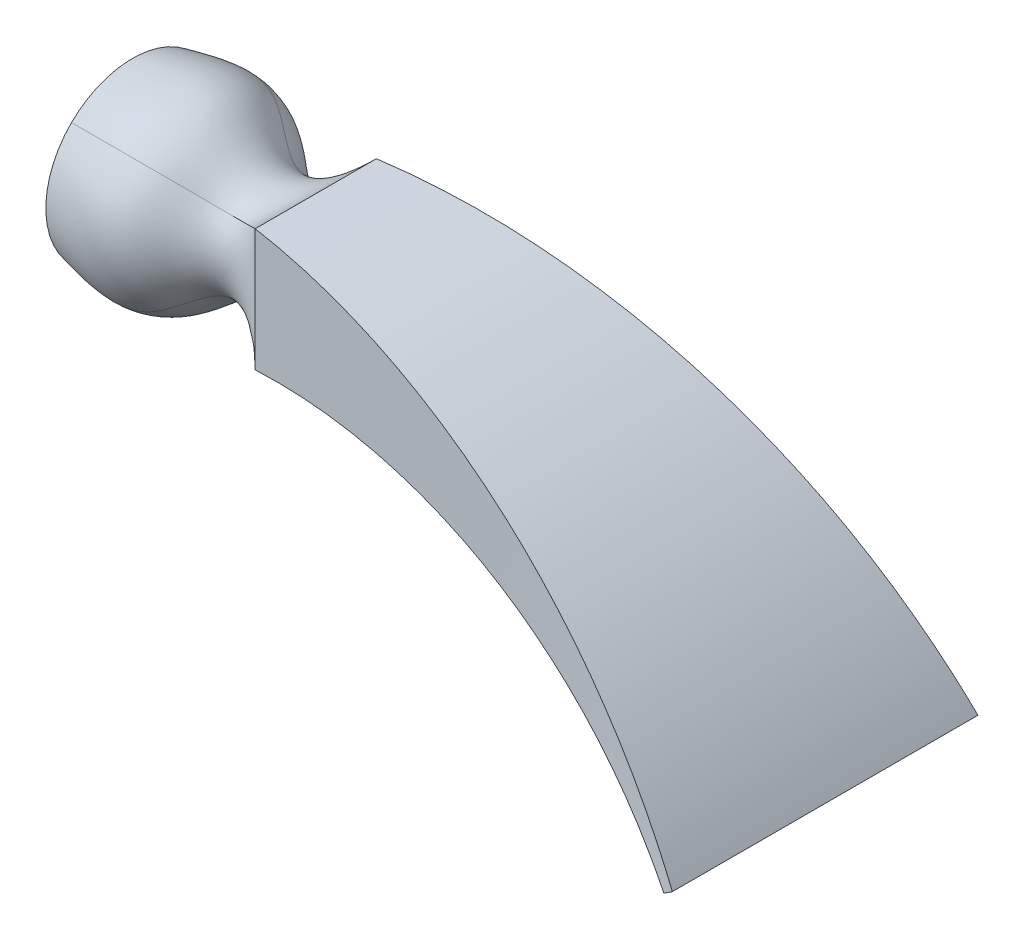
ISO-10303-21;
HEADER;
FILE_DESCRIPTION(('STEP AP214'),'2;1');
FILE_NAME('part.step','',(''),(''),'','','');
FILE_SCHEMA(('AUTOMOTIVE_DESIGN { 1 0 10303 214 1 1 1 1 }'));
ENDSEC;
DATA;
#1=APPLICATION_CONTEXT('core data for automotive mechanical design processes');
#2=APPLICATION_PROTOCOL_DEFINITION('international standard','automotive_design',2000,#1);
#3=PRODUCT_CONTEXT('',#1,'mechanical');
#4=PRODUCT('Part','Part','',(#3));
#5=PRODUCT_RELATED_PRODUCT_CATEGORY('part','',(#4));
#6=PRODUCT_DEFINITION_FORMATION('','',#4);
#7=PRODUCT_DEFINITION_CONTEXT('part definition',#1,'design');
#8=PRODUCT_DEFINITION('design','',#6,#7);
#9=PRODUCT_DEFINITION_SHAPE('','',#8);
#10=(LENGTH_UNIT() NAMED_UNIT(*) SI_UNIT(.MILLI.,.METRE.));
#11=(NAMED_UNIT(*) PLANE_ANGLE_UNIT() SI_UNIT($,.RADIAN.));
#12=(NAMED_UNIT(*) SI_UNIT($,.STERADIAN.) SOLID_ANGLE_UNIT());
#13=UNCERTAINTY_MEASURE_WITH_UNIT(LENGTH_MEASURE(1.E-05),#10,'distance_accuracy_value','');
#14=(GEOMETRIC_REPRESENTATION_CONTEXT(3) GLOBAL_UNCERTAINTY_ASSIGNED_CONTEXT((#13)) GLOBAL_UNIT_ASSIGNED_CONTEXT((#10,
#11,#12)) REPRESENTATION_CONTEXT('',''));
#15=CARTESIAN_POINT('',(0.,0.,0.));
#16=DIRECTION('',(0.,0.,1.));
#17=DIRECTION('',(1.,0.,0.));
#18=AXIS2_PLACEMENT_3D('',#15,#16,#17);
#19=CARTESIAN_POINT('',(0.,0.,0.));
#20=DIRECTION('',(1.,0.,0.));
#21=DIRECTION('',(0.,0.,-1.));
#22=AXIS2_PLACEMENT_3D('',#19,#20,#21);
#23=PLANE('',#22);
#24=CARTESIAN_POINT('',(0.,0.,0.));
#25=DIRECTION('',(1.,0.,0.));
#26=DIRECTION('',(0.,0.,-1.));
#27=AXIS2_PLACEMENT_3D('',#24,#25,#26);
#28=CIRCLE('',#27,42.5);
#29=CARTESIAN_POINT('',(0.,-30.1807389427647,-29.9227839090665));
#30=VERTEX_POINT('',#29);
#31=CARTESIAN_POINT('',(0.,30.1807389427646,-29.9227839090665));
#32=VERTEX_POINT('',#31);
#33=EDGE_CURVE('E328',#30,#32,#28,.T.);
#34=ORIENTED_EDGE('',*,*,#33,.F.);
#35=CARTESIAN_POINT('',(0.,-30.1807389427647,29.9227839090665));
#36=VERTEX_POINT('',#35);
#37=EDGE_CURVE('E333',#36,#30,#28,.T.);
#38=ORIENTED_EDGE('',*,*,#37,.F.);
#39=CARTESIAN_POINT('',(0.,30.1807389427647,29.9227839090665));
#40=VERTEX_POINT('',#39);
#41=EDGE_CURVE('E339',#40,#36,#28,.T.);
#42=ORIENTED_EDGE('',*,*,#41,.F.);
#43=EDGE_CURVE('E336',#32,#40,#28,.T.);
#44=ORIENTED_EDGE('',*,*,#43,.F.);
#45=EDGE_LOOP('',(#34,#38,#42,#44));
#46=FACE_BOUND('',#45,.T.);
#47=ADVANCED_FACE('F179',(#46),#23,.F.);
#48=CARTESIAN_POINT('',(0.,30.1807389427647,29.9227839090665));
#49=CARTESIAN_POINT('',(14.2344827586207,32.5576506885748,32.2793801698698));
#50=CARTESIAN_POINT('',(39.075112200761,36.8024435056941,36.487892706501));
#51=CARTESIAN_POINT('',(63.2703011286903,11.5236756013447,11.4251826474873));
#52=CARTESIAN_POINT('',(81.6371901141524,21.8055672932147,21.6191949231877));
#53=CARTESIAN_POINT('',(90.,30.,29.7435897435904));
#54=CARTESIAN_POINT('',(0.,28.1856718139263,31.9350498924637));
#55=CARTESIAN_POINT('',(14.2345033752936,30.3973426421206,34.4401138364509));
#56=CARTESIAN_POINT('',(39.0401593980691,34.3168229625337,38.7418698433915));
#57=CARTESIAN_POINT('',(63.3585721531963,10.9019601128463,12.7062791652942));
#58=CARTESIAN_POINT('',(81.463006869885,20.0864810901879,22.0596015987749));
#59=CARTESIAN_POINT('',(90.,27.5,29.7435897435904));
#60=CARTESIAN_POINT('',(0.,23.838624201357,35.5194678872275));
#61=CARTESIAN_POINT('',(14.2345446086393,25.7198131943193,38.3214671975825));
#62=CARTESIAN_POINT('',(38.9702537926855,28.9521532279637,42.7646827019061));
#63=CARTESIAN_POINT('',(63.5351142022081,9.39385027333037,14.9420936801908));
#64=CARTESIAN_POINT('',(81.1146403813505,16.6483086841344,22.9404149499493));
#65=CARTESIAN_POINT('',(90.0000000000001,22.5,29.7435897435904));
#66=CARTESIAN_POINT('',(0.,16.4461586886744,39.4813241775538));
#67=CARTESIAN_POINT('',(14.2344040349774,17.7403949752854,42.5894808203446));
#68=CARTESIAN_POINT('',(38.9272241139188,19.9236594843211,47.2200094175549));
#69=CARTESIAN_POINT('',(63.6439176862772,6.6107421229043,17.4087376406375));
#70=CARTESIAN_POINT('',(80.8999143592602,11.2285525991996,23.9195334519104));
#71=CARTESIAN_POINT('',(90.0000000000001,15.,29.7435897435904));
#72=CARTESIAN_POINT('',(0.,8.45557019210743,41.9339809803318));
#73=CARTESIAN_POINT('',(14.2345505476782,9.12174327247473,45.2368698899606));
#74=CARTESIAN_POINT('',(38.9060679954908,10.2233953189383,49.9791657489048));
#75=CARTESIAN_POINT('',(63.6972371834959,3.4489397791654,18.928985799055));
#76=CARTESIAN_POINT('',(80.7947216140835,5.67423491622427,24.5398668699306));
#77=CARTESIAN_POINT('',(90.,7.50000000000001,29.7435897435904));
#78=CARTESIAN_POINT('',(0.,0.,42.783009509834));
#79=CARTESIAN_POINT('',(14.2344488640919,0.,46.152254710192));
#80=CARTESIAN_POINT('',(38.9012646366428,0.,50.9342644470724));
#81=CARTESIAN_POINT('',(63.709452671535,0.,19.4561766630522));
#82=CARTESIAN_POINT('',(80.7706003535121,0.,24.7525995509965));
#83=CARTESIAN_POINT('',(89.9999999999999,0.,29.7435897435904));
#84=CARTESIAN_POINT('',(0.,-8.45557019210739,41.933980980332));
#85=CARTESIAN_POINT('',(14.2345505476783,-9.12174327247468,45.2368698899607));
#86=CARTESIAN_POINT('',(38.906067995491,-10.2233953189382,49.979165748905));
#87=CARTESIAN_POINT('',(63.6972371834958,-3.44893977916542,18.9289857990549));
#88=CARTESIAN_POINT('',(80.7947216140834,-5.67423491622429,24.5398668699305));
#89=CARTESIAN_POINT('',(90.,-7.49999999999999,29.7435897435904));
#90=CARTESIAN_POINT('',(0.,-16.4461586886745,39.4813241775537));
#91=CARTESIAN_POINT('',(14.2344040349774,-17.7403949752855,42.5894808203444));
#92=CARTESIAN_POINT('',(38.9272241139187,-19.9236594843211,47.2200094175547));
#93=CARTESIAN_POINT('',(63.6439176862774,-6.61074212290429,17.4087376406376));
#94=CARTESIAN_POINT('',(80.8999143592602,-11.2285525991995,23.9195334519104));
#95=CARTESIAN_POINT('',(90.0000000000001,-15.,29.7435897435904));
#96=CARTESIAN_POINT('',(0.,-23.838624201357,35.5194678872276));
#97=CARTESIAN_POINT('',(14.2345446086393,-25.7198131943192,38.3214671975826));
#98=CARTESIAN_POINT('',(38.9702537926856,-28.9521532279636,42.7646827019063));
#99=CARTESIAN_POINT('',(63.535114202208,-9.39385027333037,14.9420936801907));
#100=CARTESIAN_POINT('',(81.1146403813505,-16.6483086841344,22.9404149499492));
#101=CARTESIAN_POINT('',(90.,-22.5,29.7435897435904));
#102=CARTESIAN_POINT('',(0.,-28.1856718139263,31.9350498924637));
#103=CARTESIAN_POINT('',(14.2345033752936,-30.3973426421205,34.4401138364509));
#104=CARTESIAN_POINT('',(39.0401593980691,-34.3168229625337,38.7418698433915));
#105=CARTESIAN_POINT('',(63.3585721531963,-10.9019601128463,12.7062791652942));
#106=CARTESIAN_POINT('',(81.463006869885,-20.086481090188,22.0596015987749));
#107=CARTESIAN_POINT('',(90.,-27.5,29.7435897435904));
#108=CARTESIAN_POINT('',(0.,-30.1807389427647,29.9227839090665));
#109=CARTESIAN_POINT('',(14.2344827586207,-32.5576506885748,32.2793801698698));
#110=CARTESIAN_POINT('',(39.075112200761,-36.8024435056941,36.487892706501));
#111=CARTESIAN_POINT('',(63.2703011286903,-11.5236756013447,11.4251826474873));
#112=CARTESIAN_POINT('',(81.6371901141524,-21.8055672932147,21.6191949231877));
#113=CARTESIAN_POINT('',(90.,-30.,29.7435897435904));
#114=B_SPLINE_SURFACE_WITH_KNOTS('',3,3,((#48,#49,#50,#51,#52,#53),(#54,#55,#56,#57,#58,#59),
(#60,#61,#62,#63,#64,#65),(#66,#67,#68,#69,#70,#71),(#72,#73,#74,#75,#76,#77),(#78,#79,#80,#81,
#82,#83),(#84,#85,#86,#87,#88,#89),(#90,#91,#92,#93,#94,#95),(#96,#97,#98,#99,#100,#101),(#102,
#103,#104,#105,#106,#107),(#108,#109,#110,#111,#112,#113)),.UNSPECIFIED.,.F.,.F.,.F.,(4,1,1,1,1,
1,1,1,4),(4,1,1,4),(0.,0.125,0.25,0.375,0.5,0.625,0.75,0.875,1.),(0.,0.406350228999351,
0.716358770858521,1.),.UNSPECIFIED.);
#115=CARTESIAN_POINT('',(0.,-30.1807389427647,29.9227839090665));
#116=CARTESIAN_POINT('',(14.2344827586207,-32.5576506885748,32.2793801698698));
#117=CARTESIAN_POINT('',(39.075112200761,-36.8024435056941,36.487892706501));
#118=CARTESIAN_POINT('',(63.2703011286903,-11.5236756013447,11.4251826474873));
#119=CARTESIAN_POINT('',(81.6371901141524,-21.8055672932147,21.6191949231877));
#120=CARTESIAN_POINT('',(90.,-30.,29.7435897435904));
#121=B_SPLINE_CURVE_WITH_KNOTS('',3,(#115,#116,#117,#118,#119,#120),.UNSPECIFIED.,.F.,.F.,(4,1,
1,4),(0.,0.406350228999351,0.716358770858521,1.),.UNSPECIFIED.);
#122=CARTESIAN_POINT('',(90.,-30.,29.7435897435904));
#123=VERTEX_POINT('',#122);
#124=EDGE_CURVE('E394',#36,#123,#121,.T.);
#125=DIRECTION('',(0.,-1.,0.));
#126=VECTOR('',#125,1.);
#127=CARTESIAN_POINT('',(90.,30.,29.7435897435904));
#128=LINE('',#127,#126);
#129=CARTESIAN_POINT('',(90.,30.,29.7435897435904));
#130=VERTEX_POINT('',#129);
#131=EDGE_CURVE('E191',#130,#123,#128,.T.);
#132=CARTESIAN_POINT('',(0.,30.1807389427647,29.9227839090665));
#133=CARTESIAN_POINT('',(14.2344827586207,32.5576506885748,32.2793801698698));
#134=CARTESIAN_POINT('',(39.075112200761,36.8024435056941,36.487892706501));
#135=CARTESIAN_POINT('',(63.2703011286903,11.5236756013447,11.4251826474873));
#136=CARTESIAN_POINT('',(81.6371901141524,21.8055672932147,21.6191949231877));
#137=CARTESIAN_POINT('',(90.,30.,29.7435897435904));
#138=B_SPLINE_CURVE_WITH_KNOTS('',3,(#132,#133,#134,#135,#136,#137),.UNSPECIFIED.,.F.,.F.,(4,1,
1,4),(0.,0.406350228999351,0.716358770858521,1.),.UNSPECIFIED.);
#139=EDGE_CURVE('E405',#130,#40,#138,.F.);
#140=ORIENTED_EDGE('',*,*,#41,.T.);
#141=ORIENTED_EDGE('',*,*,#124,.T.);
#142=ORIENTED_EDGE('',*,*,#131,.F.);
#143=ORIENTED_EDGE('',*,*,#139,.T.);
#144=EDGE_LOOP('',(#140,#141,#142,#143));
#145=FACE_BOUND('',#144,.T.);
#146=ADVANCED_FACE('F360',(#145),#114,.T.);
#147=CARTESIAN_POINT('',(0.,-30.1807389427646,29.9227839090665));
#148=CARTESIAN_POINT('',(14.2344827586207,-32.5576506885748,32.2793801698698));
#149=CARTESIAN_POINT('',(39.075112200761,-36.8024435056941,36.487892706501));
#150=CARTESIAN_POINT('',(63.2703011286903,-11.5236756013447,11.4251826474873));
#151=CARTESIAN_POINT('',(81.6371901141524,-21.8055672932147,21.6191949231877));
#152=CARTESIAN_POINT('',(90.,-30.,29.7435897435904));
#153=CARTESIAN_POINT('',(0.,-46.5957018317999,13.3663127192641));
#154=CARTESIAN_POINT('',(14.2344827586207,-48.97261357761,14.1518448061986));
#155=CARTESIAN_POINT('',(39.075112200761,-54.8967982265609,15.9017183415848));
#156=CARTESIAN_POINT('',(63.2703011286903,-23.6966390740378,6.32386246674985));
#157=CARTESIAN_POINT('',(81.6371901141524,-21.8055672932147,7.20639830772924));
#158=CARTESIAN_POINT('',(90.,-30.,9.91452991453014));
#159=CARTESIAN_POINT('',(0.,-46.5957018317999,-13.3663127192641));
#160=CARTESIAN_POINT('',(14.2344827586207,-48.97261357761,-14.1518448061985));
#161=CARTESIAN_POINT('',(39.075112200761,-54.8967982265609,-15.9017183415847));
#162=CARTESIAN_POINT('',(63.2703011286903,-23.6966390740378,-6.32386246674984));
#163=CARTESIAN_POINT('',(81.6371901141524,-21.8055672932147,-7.20639830772924));
#164=CARTESIAN_POINT('',(90.,-30.,-9.91452991453014));
#165=CARTESIAN_POINT('',(0.,-30.1807389427647,-29.9227839090665));
#166=CARTESIAN_POINT('',(14.2344827586207,-32.5576506885748,-32.2793801698698));
#167=CARTESIAN_POINT('',(39.075112200761,-36.8024435056941,-36.487892706501));
#168=CARTESIAN_POINT('',(63.2703011286903,-11.5236756013447,-11.4251826474873));
#169=CARTESIAN_POINT('',(81.6371901141524,-21.8055672932147,-21.6191949231877));
#170=CARTESIAN_POINT('',(90.,-30.,-29.7435897435904));
#171=B_SPLINE_SURFACE_WITH_KNOTS('',3,3,((#147,#148,#149,#150,#151,#152),(#153,#154,#155,#156,
#157,#158),(#159,#160,#161,#162,#163,#164),(#165,#166,#167,#168,#169,#170)),.UNSPECIFIED.,.F.,
.F.,.F.,(4,4),(4,1,1,4),(0.,1.),(0.,0.406350228999351,0.716358770858521,1.),.UNSPECIFIED.);
#172=CARTESIAN_POINT('',(0.,-30.1807389427647,-29.9227839090665));
#173=CARTESIAN_POINT('',(14.2344827586207,-32.5576506885748,-32.2793801698698));
#174=CARTESIAN_POINT('',(39.075112200761,-36.8024435056941,-36.487892706501));
#175=CARTESIAN_POINT('',(63.2703011286903,-11.5236756013447,-11.4251826474873));
#176=CARTESIAN_POINT('',(81.6371901141524,-21.8055672932147,-21.6191949231877));
#177=CARTESIAN_POINT('',(90.,-30.,-29.7435897435904));
#178=B_SPLINE_CURVE_WITH_KNOTS('',3,(#172,#173,#174,#175,#176,#177),.UNSPECIFIED.,.F.,.F.,(4,1,
1,4),(0.,0.406350228999351,0.716358770858521,1.),.UNSPECIFIED.);
#179=CARTESIAN_POINT('',(90.,-30.,-29.7435897435904));
#180=VERTEX_POINT('',#179);
#181=EDGE_CURVE('E392',#30,#180,#178,.T.);
#182=DIRECTION('',(0.,0.,-1.));
#183=VECTOR('',#182,1.);
#184=CARTESIAN_POINT('',(90.,-30.,29.7435897435904));
#185=LINE('',#184,#183);
#186=EDGE_CURVE('E248',#123,#180,#185,.T.);
#187=ORIENTED_EDGE('',*,*,#37,.T.);
#188=ORIENTED_EDGE('',*,*,#181,.T.);
#189=ORIENTED_EDGE('',*,*,#186,.F.);
#190=ORIENTED_EDGE('',*,*,#124,.F.);
#191=EDGE_LOOP('',(#187,#188,#189,#190));
#192=FACE_BOUND('',#191,.T.);
#193=ADVANCED_FACE('F441',(#192),#171,.T.);
#194=CARTESIAN_POINT('',(0.,30.1807389427647,-29.9227839090665));
#195=CARTESIAN_POINT('',(14.2344827586207,32.5576506885748,-32.2793801698698));
#196=CARTESIAN_POINT('',(39.075112200761,36.8024435056941,-36.487892706501));
#197=CARTESIAN_POINT('',(63.2703011286903,11.5236756013447,-11.4251826474873));
#198=CARTESIAN_POINT('',(81.6371901141524,21.8055672932147,-21.6191949231877));
#199=CARTESIAN_POINT('',(90.,30.,-29.7435897435904));
#200=CARTESIAN_POINT('',(0.,46.5957018317999,-13.3663127192641));
#201=CARTESIAN_POINT('',(14.2344827586207,48.97261357761,-14.1518448061985));
#202=CARTESIAN_POINT('',(39.075112200761,54.8967982265609,-15.9017183415847));
#203=CARTESIAN_POINT('',(63.2703011286903,23.6966390740378,-6.32386246674984));
#204=CARTESIAN_POINT('',(81.6371901141524,21.8055672932147,-7.20639830772924));
#205=CARTESIAN_POINT('',(90.,30.,-9.91452991453014));
#206=CARTESIAN_POINT('',(0.,46.5957018317999,13.3663127192641));
#207=CARTESIAN_POINT('',(14.2344827586207,48.97261357761,14.1518448061986));
#208=CARTESIAN_POINT('',(39.075112200761,54.8967982265609,15.9017183415848));
#209=CARTESIAN_POINT('',(63.2703011286903,23.6966390740378,6.32386246674984));
#210=CARTESIAN_POINT('',(81.6371901141524,21.8055672932147,7.20639830772924));
#211=CARTESIAN_POINT('',(90.,30.,9.91452991453014));
#212=CARTESIAN_POINT('',(0.,30.1807389427647,29.9227839090665));
#213=CARTESIAN_POINT('',(14.2344827586207,32.5576506885748,32.2793801698698));
#214=CARTESIAN_POINT('',(39.075112200761,36.8024435056941,36.487892706501));
#215=CARTESIAN_POINT('',(63.2703011286903,11.5236756013447,11.4251826474873));
#216=CARTESIAN_POINT('',(81.6371901141524,21.8055672932147,21.6191949231877));
#217=CARTESIAN_POINT('',(90.,30.,29.7435897435904));
#218=B_SPLINE_SURFACE_WITH_KNOTS('',3,3,((#194,#195,#196,#197,#198,#199),(#200,#201,#202,#203,
#204,#205),(#206,#207,#208,#209,#210,#211),(#212,#213,#214,#215,#216,#217)),.UNSPECIFIED.,.F.,
.F.,.F.,(4,4),(4,1,1,4),(0.,1.),(0.,0.406350228999351,0.716358770858521,1.),.UNSPECIFIED.);
#219=DIRECTION('',(0.,0.,1.));
#220=VECTOR('',#219,1.);
#221=CARTESIAN_POINT('',(90.,30.,29.7435897435904));
#222=LINE('',#221,#220);
#223=CARTESIAN_POINT('',(90.,30.,-29.7435897435904));
#224=VERTEX_POINT('',#223);
#225=EDGE_CURVE('E13',#224,#130,#222,.T.);
#226=CARTESIAN_POINT('',(0.,30.1807389427646,-29.9227839090665));
#227=CARTESIAN_POINT('',(14.2344827586207,32.5576506885748,-32.2793801698698));
#228=CARTESIAN_POINT('',(39.075112200761,36.8024435056941,-36.487892706501));
#229=CARTESIAN_POINT('',(63.2703011286903,11.5236756013447,-11.4251826474873));
#230=CARTESIAN_POINT('',(81.6371901141524,21.8055672932147,-21.6191949231877));
#231=CARTESIAN_POINT('',(90.,30.,-29.7435897435904));
#232=B_SPLINE_CURVE_WITH_KNOTS('',3,(#226,#227,#228,#229,#230,#231),.UNSPECIFIED.,.F.,.F.,(4,1,
1,4),(0.,0.406350228999351,0.716358770858521,1.),.UNSPECIFIED.);
#233=EDGE_CURVE('E391',#32,#224,#232,.T.);
#234=ORIENTED_EDGE('',*,*,#43,.T.);
#235=ORIENTED_EDGE('',*,*,#139,.F.);
#236=ORIENTED_EDGE('',*,*,#225,.F.);
#237=ORIENTED_EDGE('',*,*,#233,.F.);
#238=EDGE_LOOP('',(#234,#235,#236,#237));
#239=FACE_BOUND('',#238,.T.);
#240=ADVANCED_FACE('F431',(#239),#218,.T.);
#241=CARTESIAN_POINT('',(0.,-30.1807389427647,-29.9227839090665));
#242=CARTESIAN_POINT('',(14.2344827586207,-32.5576506885748,-32.2793801698698));
#243=CARTESIAN_POINT('',(39.075112200761,-36.8024435056941,-36.487892706501));
#244=CARTESIAN_POINT('',(63.2703011286903,-11.5236756013447,-11.4251826474873));
#245=CARTESIAN_POINT('',(81.6371901141524,-21.8055672932147,-21.6191949231877));
#246=CARTESIAN_POINT('',(90.,-30.,-29.7435897435904));
#247=CARTESIAN_POINT('',(0.,-28.1856718139264,-31.9350498924637));
#248=CARTESIAN_POINT('',(14.2345033752936,-30.3973426421205,-34.4401138364509));
#249=CARTESIAN_POINT('',(39.0401593980691,-34.3168229625337,-38.7418698433915));
#250=CARTESIAN_POINT('',(63.3585721531963,-10.9019601128463,-12.7062791652942));
#251=CARTESIAN_POINT('',(81.463006869885,-20.086481090188,-22.0596015987749));
#252=CARTESIAN_POINT('',(90.,-27.5,-29.7435897435904));
#253=CARTESIAN_POINT('',(0.,-23.838624201357,-35.5194678872275));
#254=CARTESIAN_POINT('',(14.2345446086393,-25.7198131943192,-38.3214671975825));
#255=CARTESIAN_POINT('',(38.9702537926855,-28.9521532279636,-42.7646827019061));
#256=CARTESIAN_POINT('',(63.5351142022081,-9.39385027333039,-14.9420936801908));
#257=CARTESIAN_POINT('',(81.1146403813505,-16.6483086841344,-22.9404149499493));
#258=CARTESIAN_POINT('',(90.0000000000001,-22.5,-29.7435897435904));
#259=CARTESIAN_POINT('',(0.,-16.4461586886745,-39.4813241775538));
#260=CARTESIAN_POINT('',(14.2344040349774,-17.7403949752855,-42.5894808203446));
#261=CARTESIAN_POINT('',(38.9272241139188,-19.9236594843211,-47.2200094175549));
#262=CARTESIAN_POINT('',(63.6439176862772,-6.6107421229043,-17.4087376406375));
#263=CARTESIAN_POINT('',(80.8999143592602,-11.2285525991995,-23.9195334519104));
#264=CARTESIAN_POINT('',(90.0000000000001,-15.,-29.7435897435904));
#265=CARTESIAN_POINT('',(0.,-8.45557019210741,-41.9339809803318));
#266=CARTESIAN_POINT('',(14.2345505476782,-9.1217432724747,-45.2368698899606));
#267=CARTESIAN_POINT('',(38.9060679954908,-10.2233953189382,-49.9791657489048));
#268=CARTESIAN_POINT('',(63.6972371834959,-3.44893977916541,-18.928985799055));
#269=CARTESIAN_POINT('',(80.7947216140835,-5.67423491622428,-24.5398668699306));
#270=CARTESIAN_POINT('',(90.,-7.5,-29.7435897435904));
#271=CARTESIAN_POINT('',(0.,0.,-42.783009509834));
#272=CARTESIAN_POINT('',(14.2344488640919,0.,-46.152254710192));
#273=CARTESIAN_POINT('',(38.9012646366428,0.,-50.9342644470724));
#274=CARTESIAN_POINT('',(63.709452671535,0.,-19.4561766630522));
#275=CARTESIAN_POINT('',(80.7706003535121,0.,-24.7525995509965));
#276=CARTESIAN_POINT('',(89.9999999999999,0.,-29.7435897435904));
#277=CARTESIAN_POINT('',(0.,8.45557019210739,-41.933980980332));
#278=CARTESIAN_POINT('',(14.2345505476783,9.12174327247468,-45.2368698899607));
#279=CARTESIAN_POINT('',(38.906067995491,10.2233953189382,-49.979165748905));
#280=CARTESIAN_POINT('',(63.6972371834958,3.44893977916541,-18.9289857990549));
#281=CARTESIAN_POINT('',(80.7947216140834,5.67423491622428,-24.5398668699305));
#282=CARTESIAN_POINT('',(90.,7.50000000000001,-29.7435897435904));
#283=CARTESIAN_POINT('',(0.,16.4461586886744,-39.4813241775537));
#284=CARTESIAN_POINT('',(14.2344040349774,17.7403949752855,-42.5894808203444));
#285=CARTESIAN_POINT('',(38.9272241139187,19.9236594843211,-47.2200094175547));
#286=CARTESIAN_POINT('',(63.6439176862774,6.61074212290428,-17.4087376406376));
#287=CARTESIAN_POINT('',(80.8999143592602,11.2285525991995,-23.9195334519104));
#288=CARTESIAN_POINT('',(90.0000000000001,15.,-29.7435897435904));
#289=CARTESIAN_POINT('',(0.,23.8386242013569,-35.5194678872276));
#290=CARTESIAN_POINT('',(14.2345446086393,25.7198131943192,-38.3214671975826));
#291=CARTESIAN_POINT('',(38.9702537926856,28.9521532279636,-42.7646827019063));
#292=CARTESIAN_POINT('',(63.535114202208,9.39385027333038,-14.9420936801907));
#293=CARTESIAN_POINT('',(81.1146403813505,16.6483086841345,-22.9404149499492));
#294=CARTESIAN_POINT('',(90.,22.5,-29.7435897435904));
#295=CARTESIAN_POINT('',(0.,28.1856718139263,-31.9350498924637));
#296=CARTESIAN_POINT('',(14.2345033752936,30.3973426421205,-34.4401138364509));
#297=CARTESIAN_POINT('',(39.0401593980691,34.3168229625337,-38.7418698433915));
#298=CARTESIAN_POINT('',(63.3585721531963,10.9019601128463,-12.7062791652942));
#299=CARTESIAN_POINT('',(81.463006869885,20.0864810901879,-22.0596015987749));
#300=CARTESIAN_POINT('',(90.,27.5,-29.7435897435904));
#301=CARTESIAN_POINT('',(0.,30.1807389427646,-29.9227839090665));
#302=CARTESIAN_POINT('',(14.2344827586207,32.5576506885748,-32.2793801698698));
#303=CARTESIAN_POINT('',(39.075112200761,36.8024435056941,-36.487892706501));
#304=CARTESIAN_POINT('',(63.2703011286903,11.5236756013447,-11.4251826474873));
#305=CARTESIAN_POINT('',(81.6371901141524,21.8055672932147,-21.6191949231877));
#306=CARTESIAN_POINT('',(90.,30.,-29.7435897435904));
#307=B_SPLINE_SURFACE_WITH_KNOTS('',3,3,((#241,#242,#243,#244,#245,#246),(#247,#248,#249,#250,
#251,#252),(#253,#254,#255,#256,#257,#258),(#259,#260,#261,#262,#263,#264),(#265,#266,#267,#268,
#269,#270),(#271,#272,#273,#274,#275,#276),(#277,#278,#279,#280,#281,#282),(#283,#284,#285,#286,
#287,#288),(#289,#290,#291,#292,#293,#294),(#295,#296,#297,#298,#299,#300),(#301,#302,#303,#304,
#305,#306)),.UNSPECIFIED.,.F.,.F.,.F.,(4,1,1,1,1,1,1,1,4),(4,1,1,4),(0.,0.125,0.25,0.375,0.5,
0.625,0.75,0.875,1.),(0.,0.406350228999351,0.716358770858521,1.),.UNSPECIFIED.);
#308=DIRECTION('',(0.,1.,0.));
#309=VECTOR('',#308,1.);
#310=CARTESIAN_POINT('',(90.,30.,-29.7435897435904));
#311=LINE('',#310,#309);
#312=EDGE_CURVE('E206',#180,#224,#311,.T.);
#313=ORIENTED_EDGE('',*,*,#33,.T.);
#314=ORIENTED_EDGE('',*,*,#233,.T.);
#315=ORIENTED_EDGE('',*,*,#312,.F.);
#316=ORIENTED_EDGE('',*,*,#181,.F.);
#317=EDGE_LOOP('',(#313,#314,#315,#316));
#318=FACE_BOUND('',#317,.T.);
#319=ADVANCED_FACE('F181',(#318),#307,.T.);
#320=CARTESIAN_POINT('',(151.873429638329,-228.957809879443,0.));
#321=DIRECTION('',(-0.552770798392569,0.833333333333332,0.));
#322=DIRECTION('',(-0.833333333333332,-0.552770798392569,0.));
#323=AXIS2_PLACEMENT_3D('',#320,#321,#322);
#324=PLANE('',#323);
#325=DIRECTION('',(0.,0.,1.));
#326=VECTOR('',#325,1.);
#327=CARTESIAN_POINT('',(340.,-104.16876048223,-75.));
#328=LINE('',#327,#326);
#329=CARTESIAN_POINT('',(340.,-104.16876048223,-75.));
#330=VERTEX_POINT('',#329);
#331=CARTESIAN_POINT('',(340.,-104.16876048223,75.));
#332=VERTEX_POINT('',#331);
#333=EDGE_CURVE('E311',#330,#332,#328,.T.);
#334=ORIENTED_EDGE('',*,*,#333,.T.);
#335=DIRECTION('',(-0.833333333333332,-0.552770798392569,0.));
#336=VECTOR('',#335,1.);
#337=CARTESIAN_POINT('',(335.833333333333,-106.932614474193,75.));
#338=LINE('',#337,#336);
#339=CARTESIAN_POINT('',(335.833333333333,-106.932614474193,75.));
#340=VERTEX_POINT('',#339);
#341=EDGE_CURVE('E268',#332,#340,#338,.T.);
#342=ORIENTED_EDGE('',*,*,#341,.T.);
#343=DIRECTION('',(0.,0.,-1.));
#344=VECTOR('',#343,1.);
#345=CARTESIAN_POINT('',(335.833333333333,-106.932614474193,-75.));
#346=LINE('',#345,#344);
#347=CARTESIAN_POINT('',(335.833333333333,-106.932614474193,-75.));
#348=VERTEX_POINT('',#347);
#349=EDGE_CURVE('E245',#340,#348,#346,.T.);
#350=ORIENTED_EDGE('',*,*,#349,.T.);
#351=DIRECTION('',(0.833333333333334,0.552770798392565,0.));
#352=VECTOR('',#351,1.);
#353=CARTESIAN_POINT('',(335.833333333333,-106.932614474193,-75.));
#354=LINE('',#353,#352);
#355=EDGE_CURVE('E254',#348,#330,#354,.T.);
#356=ORIENTED_EDGE('',*,*,#355,.T.);
#357=EDGE_LOOP('',(#334,#342,#350,#356));
#358=FACE_BOUND('',#357,.T.);
#359=ADVANCED_FACE('F267',(#358),#324,.F.);
#360=CARTESIAN_POINT('',(90.,30.,-29.7435897435904));
#361=CARTESIAN_POINT('',(190.541679184982,30.,-44.8290598290603));
#362=CARTESIAN_POINT('',(284.423495725188,-20.3840278280784,-59.9145299145301));
#363=CARTESIAN_POINT('',(340.,-104.16876048223,-75.));
#364=CARTESIAN_POINT('',(90.,30.,-25.4188435719088));
#365=CARTESIAN_POINT('',(190.541679184982,30.,-40.6608282807347));
#366=CARTESIAN_POINT('',(284.423495725188,-20.3840278280784,-55.9028129895607));
#367=CARTESIAN_POINT('',(340.,-104.16876048223,-71.1447976983867));
#368=CARTESIAN_POINT('',(90.0000000000001,30.,-20.3965397397558));
#369=CARTESIAN_POINT('',(190.541679184982,30.,-34.4239884974845));
#370=CARTESIAN_POINT('',(284.423495725189,-20.3840278280784,-48.4514372552131));
#371=CARTESIAN_POINT('',(340.,-104.16876048223,-62.4788860129418));
#372=CARTESIAN_POINT('',(89.9999999999999,30.,-13.2831704179637));
#373=CARTESIAN_POINT('',(190.541679184982,30.,-23.9708507884073));
#374=CARTESIAN_POINT('',(284.423495725188,-20.3840278280784,-34.6585311588509));
#375=CARTESIAN_POINT('',(340.,-104.16876048223,-45.3462115292945));
#376=CARTESIAN_POINT('',(90.0000000000001,30.,-7.01390888564618));
#377=CARTESIAN_POINT('',(190.541679184982,30.0000000000001,-11.740362593087));
#378=CARTESIAN_POINT('',(284.423495725188,-20.3840278280783,-16.4668163005278));
#379=CARTESIAN_POINT('',(340.,-104.16876048223,-21.1932700079687));
#380=CARTESIAN_POINT('',(90.,30.,-2.47863247863253));
#381=CARTESIAN_POINT('',(190.541679184982,30.,-3.73575498575502));
#382=CARTESIAN_POINT('',(284.423495725188,-20.3840278280784,-4.99287749287751));
#383=CARTESIAN_POINT('',(340.,-104.16876048223,-6.25));
#384=CARTESIAN_POINT('',(90.,30.,2.47863247863253));
#385=CARTESIAN_POINT('',(190.541679184982,30.,3.73575498575502));
#386=CARTESIAN_POINT('',(284.423495725188,-20.3840278280784,4.99287749287751));
#387=CARTESIAN_POINT('',(340.,-104.16876048223,6.25));
#388=CARTESIAN_POINT('',(90.,30.,7.01390888564618));
#389=CARTESIAN_POINT('',(190.541679184982,30.,11.740362593087));
#390=CARTESIAN_POINT('',(284.423495725188,-20.3840278280784,16.4668163005279));
#391=CARTESIAN_POINT('',(340.,-104.16876048223,21.1932700079687));
#392=CARTESIAN_POINT('',(90.,30.,13.2831704179637));
#393=CARTESIAN_POINT('',(190.541679184982,30.,23.9708507884073));
#394=CARTESIAN_POINT('',(284.423495725188,-20.3840278280784,34.6585311588509));
#395=CARTESIAN_POINT('',(340.,-104.16876048223,45.3462115292945));
#396=CARTESIAN_POINT('',(90.,30.,20.3965397397558));
#397=CARTESIAN_POINT('',(190.541679184982,30.,34.4239884974845));
#398=CARTESIAN_POINT('',(284.423495725188,-20.3840278280784,48.4514372552131));
#399=CARTESIAN_POINT('',(340.,-104.16876048223,62.4788860129418));
#400=CARTESIAN_POINT('',(90.,30.,25.4188435719088));
#401=CARTESIAN_POINT('',(190.541679184982,30.,40.6608282807347));
#402=CARTESIAN_POINT('',(284.423495725188,-20.3840278280784,55.9028129895607));
#403=CARTESIAN_POINT('',(340.,-104.16876048223,71.1447976983867));
#404=CARTESIAN_POINT('',(90.,30.,29.7435897435904));
#405=CARTESIAN_POINT('',(190.541679184982,30.,44.8290598290603));
#406=CARTESIAN_POINT('',(284.423495725188,-20.3840278280784,59.9145299145301));
#407=CARTESIAN_POINT('',(340.,-104.16876048223,75.));
#408=B_SPLINE_SURFACE_WITH_KNOTS('',3,3,((#360,#361,#362,#363),(#364,#365,#366,#367),(#368,#369,
#370,#371),(#372,#373,#374,#375),(#376,#377,#378,#379),(#380,#381,#382,#383),(#384,#385,#386,
#387),(#388,#389,#390,#391),(#392,#393,#394,#395),(#396,#397,#398,#399),(#400,#401,#402,#403),
(#404,#405,#406,#407)),.UNSPECIFIED.,.F.,.F.,.F.,(4,1,1,1,2,1,1,1,4),(4,4),(0.633600996815726,
0.67940087221376,0.725200747611795,0.771000623009829,0.816800498407863,0.862600373805897,
0.908400249203931,0.954200124601966,1.),(0.,1.),.UNSPECIFIED.);
#409=CARTESIAN_POINT('',(90.,30.,29.7435897435904));
#410=CARTESIAN_POINT('',(190.541679184982,30.,44.8290598290603));
#411=CARTESIAN_POINT('',(284.423495725188,-20.3840278280784,59.9145299145301));
#412=CARTESIAN_POINT('',(340.,-104.16876048223,75.));
#413=B_SPLINE_CURVE_WITH_KNOTS('',3,(#409,#410,#411,#412),.UNSPECIFIED.,.F.,.F.,(4,4),(0.,1.),.UNSPECIFIED.);
#414=EDGE_CURVE('E468',#130,#332,#413,.T.);
#415=CARTESIAN_POINT('',(90.,30.,-29.7435897435904));
#416=CARTESIAN_POINT('',(190.541679184982,30.,-44.8290598290603));
#417=CARTESIAN_POINT('',(284.423495725188,-20.3840278280784,-59.9145299145301));
#418=CARTESIAN_POINT('',(340.,-104.16876048223,-75.));
#419=B_SPLINE_CURVE_WITH_KNOTS('',3,(#415,#416,#417,#418),.UNSPECIFIED.,.F.,.F.,(4,4),(0.,1.),.UNSPECIFIED.);
#420=EDGE_CURVE('E250',#224,#330,#419,.T.);
#421=ORIENTED_EDGE('',*,*,#225,.T.);
#422=ORIENTED_EDGE('',*,*,#414,.T.);
#423=ORIENTED_EDGE('',*,*,#333,.F.);
#424=ORIENTED_EDGE('',*,*,#420,.F.);
#425=EDGE_LOOP('',(#421,#422,#423,#424));
#426=FACE_BOUND('',#425,.T.);
#427=ADVANCED_FACE('F287',(#426),#408,.T.);
#428=CARTESIAN_POINT('',(90.,-30.,-29.7435897435904));
#429=CARTESIAN_POINT('',(189.152790296093,-10.9212846639876,-44.8290598290603));
#430=CARTESIAN_POINT('',(281.64571794741,-42.2265971560536,-59.9145299145301));
#431=CARTESIAN_POINT('',(335.833333333333,-106.932614474193,-75.));
#432=CARTESIAN_POINT('',(90.,-25.,-29.7435897435904));
#433=CARTESIAN_POINT('',(189.268531036834,-7.51117760865525,-44.8290598290603));
#434=CARTESIAN_POINT('',(281.877199428892,-40.406383045389,-59.9145299145301));
#435=CARTESIAN_POINT('',(336.180555555556,-106.702293308196,-75.));
#436=CARTESIAN_POINT('',(89.9999999999999,-15.,-29.7435897435904));
#437=CARTESIAN_POINT('',(189.500012518315,-0.690963497990693,-44.8290598290603));
#438=CARTESIAN_POINT('',(282.340162391855,-36.7659548240598,-59.9145299145301));
#439=CARTESIAN_POINT('',(336.875,-106.241650976202,-74.9999999999999));
#440=CARTESIAN_POINT('',(90.0000000000002,0.,-29.7435897435904));
#441=CARTESIAN_POINT('',(189.847234740538,9.53935766800628,-44.8290598290603));
#442=CARTESIAN_POINT('',(283.0346068363,-31.3053124920659,-59.9145299145302));
#443=CARTESIAN_POINT('',(337.916666666667,-105.550687478211,-75.0000000000001));
#444=CARTESIAN_POINT('',(89.9999999999999,15.,-29.7435897435904));
#445=CARTESIAN_POINT('',(190.194456962759,19.7696788340031,-44.8290598290602));
#446=CARTESIAN_POINT('',(283.729051280744,-25.8446701600722,-59.9145299145301));
#447=CARTESIAN_POINT('',(338.958333333333,-104.859723980221,-74.9999999999999));
#448=CARTESIAN_POINT('',(90.,25.,-29.7435897435904));
#449=CARTESIAN_POINT('',(190.425938444241,26.5898929446677,-44.8290598290603));
#450=CARTESIAN_POINT('',(284.192014243707,-22.204241938743,-59.9145299145301));
#451=CARTESIAN_POINT('',(339.652777777778,-104.399081648227,-75.));
#452=CARTESIAN_POINT('',(90.,30.,-29.7435897435904));
#453=CARTESIAN_POINT('',(190.541679184982,30.,-44.8290598290603));
#454=CARTESIAN_POINT('',(284.423495725188,-20.3840278280784,-59.9145299145301));
#455=CARTESIAN_POINT('',(340.,-104.16876048223,-75.));
#456=B_SPLINE_SURFACE_WITH_KNOTS('',3,3,((#428,#429,#430,#431),(#432,#433,#434,#435),(#436,#437,
#438,#439),(#440,#441,#442,#443),(#444,#445,#446,#447),(#448,#449,#450,#451),(#452,#453,#454,
#455)),.UNSPECIFIED.,.F.,.F.,.F.,(4,1,1,1,4),(4,4),(0.5,0.533400249203932,0.566800498407863,
0.600200747611795,0.633600996815726),(0.,1.),.UNSPECIFIED.);
#457=CARTESIAN_POINT('',(90.,-30.,-29.7435897435904));
#458=CARTESIAN_POINT('',(189.152790296093,-10.9212846639876,-44.8290598290603));
#459=CARTESIAN_POINT('',(281.64571794741,-42.2265971560536,-59.9145299145301));
#460=CARTESIAN_POINT('',(335.833333333333,-106.932614474193,-75.));
#461=B_SPLINE_CURVE_WITH_KNOTS('',3,(#457,#458,#459,#460),.UNSPECIFIED.,.F.,.F.,(4,4),(0.,1.),.UNSPECIFIED.);
#462=EDGE_CURVE('E240',#180,#348,#461,.T.);
#463=ORIENTED_EDGE('',*,*,#312,.T.);
#464=ORIENTED_EDGE('',*,*,#420,.T.);
#465=ORIENTED_EDGE('',*,*,#355,.F.);
#466=ORIENTED_EDGE('',*,*,#462,.F.);
#467=EDGE_LOOP('',(#463,#464,#465,#466));
#468=FACE_BOUND('',#467,.T.);
#469=ADVANCED_FACE('F256',(#468),#456,.T.);
#470=CARTESIAN_POINT('',(90.,-30.,29.7435897435904));
#471=CARTESIAN_POINT('',(189.152790296093,-10.9212846639876,44.8290598290603));
#472=CARTESIAN_POINT('',(281.64571794741,-42.2265971560536,59.9145299145302));
#473=CARTESIAN_POINT('',(335.833333333333,-106.932614474193,75.));
#474=CARTESIAN_POINT('',(90.,-30.,24.7863247863253));
#475=CARTESIAN_POINT('',(189.152790296093,-10.9212846639876,37.3575498575502));
#476=CARTESIAN_POINT('',(281.64571794741,-42.2265971560536,49.9287749287751));
#477=CARTESIAN_POINT('',(335.833333333333,-106.932614474193,62.5));
#478=CARTESIAN_POINT('',(90.,-30.,14.8717948717952));
#479=CARTESIAN_POINT('',(189.152790296093,-10.9212846639876,22.4145299145301));
#480=CARTESIAN_POINT('',(281.645717947411,-42.2265971560536,29.9572649572651));
#481=CARTESIAN_POINT('',(335.833333333334,-106.932614474193,37.5));
#482=CARTESIAN_POINT('',(90.,-30.,0.));
#483=CARTESIAN_POINT('',(189.152790296093,-10.9212846639876,0.));
#484=CARTESIAN_POINT('',(281.64571794741,-42.2265971560536,0.));
#485=CARTESIAN_POINT('',(335.833333333333,-106.932614474193,0.));
#486=CARTESIAN_POINT('',(90.,-30.,-14.8717948717952));
#487=CARTESIAN_POINT('',(189.152790296093,-10.9212846639876,-22.4145299145301));
#488=CARTESIAN_POINT('',(281.645717947411,-42.2265971560536,-29.9572649572651));
#489=CARTESIAN_POINT('',(335.833333333334,-106.932614474193,-37.5));
#490=CARTESIAN_POINT('',(90.,-30.,-24.7863247863253));
#491=CARTESIAN_POINT('',(189.152790296093,-10.9212846639876,-37.3575498575502));
#492=CARTESIAN_POINT('',(281.64571794741,-42.2265971560536,-49.9287749287751));
#493=CARTESIAN_POINT('',(335.833333333333,-106.932614474193,-62.5));
#494=CARTESIAN_POINT('',(90.,-30.,-29.7435897435904));
#495=CARTESIAN_POINT('',(189.152790296093,-10.9212846639876,-44.8290598290603));
#496=CARTESIAN_POINT('',(281.64571794741,-42.2265971560536,-59.9145299145301));
#497=CARTESIAN_POINT('',(335.833333333333,-106.932614474193,-75.));
#498=B_SPLINE_SURFACE_WITH_KNOTS('',3,3,((#470,#471,#472,#473),(#474,#475,#476,#477),(#478,#479,
#480,#481),(#482,#483,#484,#485),(#486,#487,#488,#489),(#490,#491,#492,#493),(#494,#495,#496,
#497)),.UNSPECIFIED.,.F.,.F.,.F.,(4,1,1,1,4),(4,4),(0.133600996815726,0.225200747611795,
0.316800498407863,0.408400249203931,0.5),(0.,1.),.UNSPECIFIED.);
#499=CARTESIAN_POINT('',(90.,-30.,29.7435897435904));
#500=CARTESIAN_POINT('',(189.152790296093,-10.9212846639876,44.8290598290603));
#501=CARTESIAN_POINT('',(281.64571794741,-42.2265971560536,59.9145299145302));
#502=CARTESIAN_POINT('',(335.833333333333,-106.932614474193,75.));
#503=B_SPLINE_CURVE_WITH_KNOTS('',3,(#499,#500,#501,#502),.UNSPECIFIED.,.F.,.F.,(4,4),(0.,1.),.UNSPECIFIED.);
#504=EDGE_CURVE('E251',#123,#340,#503,.T.);
#505=ORIENTED_EDGE('',*,*,#186,.T.);
#506=ORIENTED_EDGE('',*,*,#462,.T.);
#507=ORIENTED_EDGE('',*,*,#349,.F.);
#508=ORIENTED_EDGE('',*,*,#504,.F.);
#509=EDGE_LOOP('',(#505,#506,#507,#508));
#510=FACE_BOUND('',#509,.T.);
#511=ADVANCED_FACE('F242',(#510),#498,.T.);
#512=CARTESIAN_POINT('',(90.,30.,29.7435897435904));
#513=CARTESIAN_POINT('',(190.541679184982,30.,44.8290598290603));
#514=CARTESIAN_POINT('',(284.423495725188,-20.3840278280784,59.9145299145301));
#515=CARTESIAN_POINT('',(340.,-104.16876048223,75.));
#516=CARTESIAN_POINT('',(90.,25.,29.7435897435904));
#517=CARTESIAN_POINT('',(190.425938444241,26.5898929446677,44.8290598290603));
#518=CARTESIAN_POINT('',(284.192014243707,-22.204241938743,59.9145299145301));
#519=CARTESIAN_POINT('',(339.652777777778,-104.399081648227,75.));
#520=CARTESIAN_POINT('',(90.0000000000001,15.,29.7435897435904));
#521=CARTESIAN_POINT('',(190.19445696276,19.7696788340031,44.8290598290603));
#522=CARTESIAN_POINT('',(283.729051280744,-25.8446701600722,59.9145299145302));
#523=CARTESIAN_POINT('',(338.958333333334,-104.859723980221,75.));
#524=CARTESIAN_POINT('',(89.9999999999999,0.,29.7435897435904));
#525=CARTESIAN_POINT('',(189.847234740537,9.53935766800627,44.8290598290603));
#526=CARTESIAN_POINT('',(283.034606836299,-31.3053124920659,59.9145299145302));
#527=CARTESIAN_POINT('',(337.916666666666,-105.550687478211,75.0000000000001));
#528=CARTESIAN_POINT('',(90.,-15.,29.7435897435904));
#529=CARTESIAN_POINT('',(189.500012518315,-0.690963497990672,44.8290598290602));
#530=CARTESIAN_POINT('',(282.340162391855,-36.7659548240598,59.9145299145301));
#531=CARTESIAN_POINT('',(336.875,-106.241650976202,75.));
#532=CARTESIAN_POINT('',(90.,-25.,29.7435897435904));
#533=CARTESIAN_POINT('',(189.268531036834,-7.51117760865527,44.8290598290603));
#534=CARTESIAN_POINT('',(281.877199428892,-40.406383045389,59.9145299145301));
#535=CARTESIAN_POINT('',(336.180555555555,-106.702293308196,75.));
#536=CARTESIAN_POINT('',(90.,-30.,29.7435897435904));
#537=CARTESIAN_POINT('',(189.152790296093,-10.9212846639876,44.8290598290603));
#538=CARTESIAN_POINT('',(281.64571794741,-42.2265971560536,59.9145299145302));
#539=CARTESIAN_POINT('',(335.833333333333,-106.932614474193,75.));
#540=B_SPLINE_SURFACE_WITH_KNOTS('',3,3,((#512,#513,#514,#515),(#516,#517,#518,#519),(#520,#521,
#522,#523),(#524,#525,#526,#527),(#528,#529,#530,#531),(#532,#533,#534,#535),(#536,#537,#538,
#539)),.UNSPECIFIED.,.F.,.F.,.F.,(4,1,1,1,4),(4,4),(0.,0.0334002492039315,0.066800498407863,
0.100200747611795,0.133600996815726),(0.,1.),.UNSPECIFIED.);
#541=ORIENTED_EDGE('',*,*,#131,.T.);
#542=ORIENTED_EDGE('',*,*,#504,.T.);
#543=ORIENTED_EDGE('',*,*,#341,.F.);
#544=ORIENTED_EDGE('',*,*,#414,.F.);
#545=EDGE_LOOP('',(#541,#542,#543,#544));
#546=FACE_BOUND('',#545,.T.);
#547=ADVANCED_FACE('F288',(#546),#540,.T.);
#548=CLOSED_SHELL('',(#47,#146,#193,#240,#319,#359,#427,#469,#511,#547));
#549=MANIFOLD_SOLID_BREP('B2',#548);
#550=ADVANCED_BREP_SHAPE_REPRESENTATION('',(#18,#549),#14);
#551=SHAPE_DEFINITION_REPRESENTATION(#9,#550);
ENDSEC;
END-ISO-10303-21;
